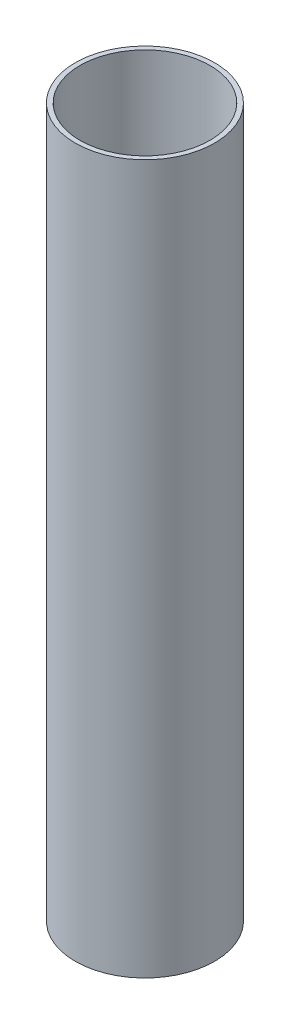
ISO-10303-21;
HEADER;
FILE_DESCRIPTION(('STEP AP214'),'2;1');
FILE_NAME('part.step','',(''),(''),'','','');
FILE_SCHEMA(('AUTOMOTIVE_DESIGN { 1 0 10303 214 1 1 1 1 }'));
ENDSEC;
DATA;
#1=APPLICATION_CONTEXT('core data for automotive mechanical design processes');
#2=APPLICATION_PROTOCOL_DEFINITION('international standard','automotive_design',2000,#1);
#3=PRODUCT_CONTEXT('',#1,'mechanical');
#4=PRODUCT('Part','Part','',(#3));
#5=PRODUCT_RELATED_PRODUCT_CATEGORY('part','',(#4));
#6=PRODUCT_DEFINITION_FORMATION('','',#4);
#7=PRODUCT_DEFINITION_CONTEXT('part definition',#1,'design');
#8=PRODUCT_DEFINITION('design','',#6,#7);
#9=PRODUCT_DEFINITION_SHAPE('','',#8);
#10=(LENGTH_UNIT() NAMED_UNIT(*) SI_UNIT(.MILLI.,.METRE.));
#11=(NAMED_UNIT(*) PLANE_ANGLE_UNIT() SI_UNIT($,.RADIAN.));
#12=(NAMED_UNIT(*) SI_UNIT($,.STERADIAN.) SOLID_ANGLE_UNIT());
#13=UNCERTAINTY_MEASURE_WITH_UNIT(LENGTH_MEASURE(1.E-05),#10,'distance_accuracy_value','');
#14=(GEOMETRIC_REPRESENTATION_CONTEXT(3) GLOBAL_UNCERTAINTY_ASSIGNED_CONTEXT((#13)) GLOBAL_UNIT_ASSIGNED_CONTEXT((#10,
#11,#12)) REPRESENTATION_CONTEXT('',''));
#15=CARTESIAN_POINT('',(0.,0.,0.));
#16=DIRECTION('',(0.,0.,1.));
#17=DIRECTION('',(1.,0.,0.));
#18=AXIS2_PLACEMENT_3D('',#15,#16,#17);
#19=CARTESIAN_POINT('',(0.,300.,0.));
#20=DIRECTION('',(0.,1.,0.));
#21=DIRECTION('',(0.,0.,1.));
#22=AXIS2_PLACEMENT_3D('',#19,#20,#21);
#23=PLANE('',#22);
#24=CARTESIAN_POINT('',(0.,300.,0.));
#25=DIRECTION('',(0.,1.,0.));
#26=DIRECTION('',(0.,0.,1.));
#27=AXIS2_PLACEMENT_3D('',#24,#25,#26);
#28=CIRCLE('',#27,29.5);
#29=CARTESIAN_POINT('',(0.,300.,29.5));
#30=VERTEX_POINT('',#29);
#31=EDGE_CURVE('E10',#30,#30,#28,.T.);
#32=ORIENTED_EDGE('',*,*,#31,.T.);
#33=EDGE_LOOP('',(#32));
#34=FACE_BOUND('',#33,.T.);
#35=CARTESIAN_POINT('',(0.,300.,0.));
#36=DIRECTION('',(0.,1.,0.));
#37=DIRECTION('',(0.,0.,1.));
#38=AXIS2_PLACEMENT_3D('',#35,#36,#37);
#39=CIRCLE('',#38,27.5);
#40=CARTESIAN_POINT('',(0.,300.,27.5));
#41=VERTEX_POINT('',#40);
#42=EDGE_CURVE('E44',#41,#41,#39,.T.);
#43=ORIENTED_EDGE('',*,*,#42,.F.);
#44=EDGE_LOOP('',(#43));
#45=FACE_BOUND('',#44,.T.);
#46=ADVANCED_FACE('F33',(#34,#45),#23,.T.);
#47=CARTESIAN_POINT('',(0.,0.,0.));
#48=DIRECTION('',(0.,1.,0.));
#49=DIRECTION('',(0.,0.,1.));
#50=AXIS2_PLACEMENT_3D('',#47,#48,#49);
#51=PLANE('',#50);
#52=CARTESIAN_POINT('',(0.,0.,0.));
#53=DIRECTION('',(0.,1.,0.));
#54=DIRECTION('',(0.,0.,1.));
#55=AXIS2_PLACEMENT_3D('',#52,#53,#54);
#56=CIRCLE('',#55,29.5);
#57=CARTESIAN_POINT('',(0.,0.,29.5));
#58=VERTEX_POINT('',#57);
#59=EDGE_CURVE('E37',#58,#58,#56,.T.);
#60=ORIENTED_EDGE('',*,*,#59,.F.);
#61=EDGE_LOOP('',(#60));
#62=FACE_BOUND('',#61,.T.);
#63=CARTESIAN_POINT('',(0.,0.,0.));
#64=DIRECTION('',(0.,1.,0.));
#65=DIRECTION('',(0.,0.,1.));
#66=AXIS2_PLACEMENT_3D('',#63,#64,#65);
#67=CIRCLE('',#66,27.5);
#68=CARTESIAN_POINT('',(0.,0.,27.5));
#69=VERTEX_POINT('',#68);
#70=EDGE_CURVE('E46',#69,#69,#67,.T.);
#71=ORIENTED_EDGE('',*,*,#70,.T.);
#72=EDGE_LOOP('',(#71));
#73=FACE_BOUND('',#72,.T.);
#74=ADVANCED_FACE('F56',(#62,#73),#51,.F.);
#75=CARTESIAN_POINT('',(0.,300.,0.));
#76=DIRECTION('',(0.,-1.,0.));
#77=DIRECTION('',(0.,0.,-1.));
#78=AXIS2_PLACEMENT_3D('',#75,#76,#77);
#79=CYLINDRICAL_SURFACE('',#78,29.5);
#80=ORIENTED_EDGE('',*,*,#31,.F.);
#81=EDGE_LOOP('',(#80));
#82=FACE_BOUND('',#81,.T.);
#83=ORIENTED_EDGE('',*,*,#59,.T.);
#84=EDGE_LOOP('',(#83));
#85=FACE_BOUND('',#84,.T.);
#86=ADVANCED_FACE('F35',(#82,#85),#79,.T.);
#87=CARTESIAN_POINT('',(0.,300.,0.));
#88=DIRECTION('',(0.,-1.,0.));
#89=DIRECTION('',(0.,0.,-1.));
#90=AXIS2_PLACEMENT_3D('',#87,#88,#89);
#91=CYLINDRICAL_SURFACE('',#90,27.5);
#92=ORIENTED_EDGE('',*,*,#42,.T.);
#93=EDGE_LOOP('',(#92));
#94=FACE_BOUND('',#93,.T.);
#95=ORIENTED_EDGE('',*,*,#70,.F.);
#96=EDGE_LOOP('',(#95));
#97=FACE_BOUND('',#96,.T.);
#98=ADVANCED_FACE('F52',(#94,#97),#91,.F.);
#99=CLOSED_SHELL('',(#46,#74,#86,#98));
#100=MANIFOLD_SOLID_BREP('B2',#99);
#101=ADVANCED_BREP_SHAPE_REPRESENTATION('',(#18,#100),#14);
#102=SHAPE_DEFINITION_REPRESENTATION(#9,#101);
ENDSEC;
END-ISO-10303-21;
